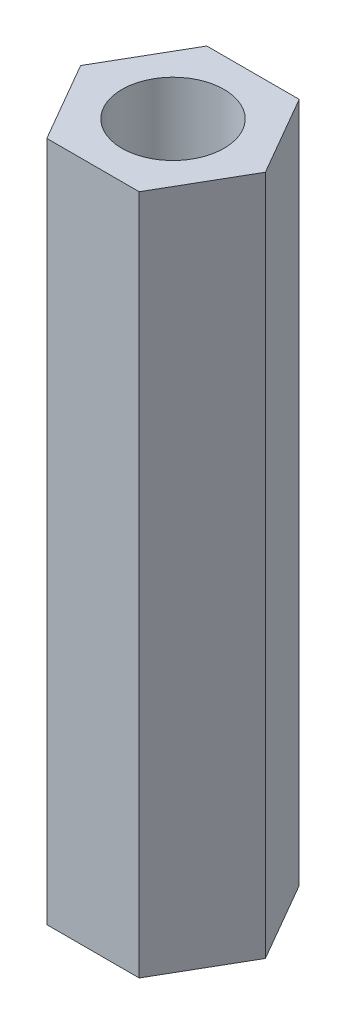
ISO-10303-21;
HEADER;
FILE_DESCRIPTION(('STEP AP214'),'2;1');
FILE_NAME('part.step','',(''),(''),'','','');
FILE_SCHEMA(('AUTOMOTIVE_DESIGN { 1 0 10303 214 1 1 1 1 }'));
ENDSEC;
DATA;
#1=APPLICATION_CONTEXT('core data for automotive mechanical design processes');
#2=APPLICATION_PROTOCOL_DEFINITION('international standard','automotive_design',2000,#1);
#3=PRODUCT_CONTEXT('',#1,'mechanical');
#4=PRODUCT('Part','Part','',(#3));
#5=PRODUCT_RELATED_PRODUCT_CATEGORY('part','',(#4));
#6=PRODUCT_DEFINITION_FORMATION('','',#4);
#7=PRODUCT_DEFINITION_CONTEXT('part definition',#1,'design');
#8=PRODUCT_DEFINITION('design','',#6,#7);
#9=PRODUCT_DEFINITION_SHAPE('','',#8);
#10=(LENGTH_UNIT() NAMED_UNIT(*) SI_UNIT(.MILLI.,.METRE.));
#11=(NAMED_UNIT(*) PLANE_ANGLE_UNIT() SI_UNIT($,.RADIAN.));
#12=(NAMED_UNIT(*) SI_UNIT($,.STERADIAN.) SOLID_ANGLE_UNIT());
#13=UNCERTAINTY_MEASURE_WITH_UNIT(LENGTH_MEASURE(1.E-05),#10,'distance_accuracy_value','');
#14=(GEOMETRIC_REPRESENTATION_CONTEXT(3) GLOBAL_UNCERTAINTY_ASSIGNED_CONTEXT((#13)) GLOBAL_UNIT_ASSIGNED_CONTEXT((#10,
#11,#12)) REPRESENTATION_CONTEXT('',''));
#15=CARTESIAN_POINT('',(0.,0.,0.));
#16=DIRECTION('',(0.,0.,1.));
#17=DIRECTION('',(1.,0.,0.));
#18=AXIS2_PLACEMENT_3D('',#15,#16,#17);
#19=CARTESIAN_POINT('',(0.,20.,0.));
#20=DIRECTION('',(0.,1.,0.));
#21=DIRECTION('',(0.,0.,1.));
#22=AXIS2_PLACEMENT_3D('',#19,#20,#21);
#23=PLANE('',#22);
#24=DIRECTION('',(0.499999999999985,0.,-0.866025403784447));
#25=VECTOR('',#24,1.);
#26=CARTESIAN_POINT('',(1.35677313259566,20.,2.35000000000002));
#27=LINE('',#26,#25);
#28=CARTESIAN_POINT('',(1.35677313259566,20.,2.35000000000002));
#29=VERTEX_POINT('',#28);
#30=CARTESIAN_POINT('',(2.71354626519124,20.,0.));
#31=VERTEX_POINT('',#30);
#32=EDGE_CURVE('E128',#29,#31,#27,.T.);
#33=ORIENTED_EDGE('',*,*,#32,.T.);
#34=DIRECTION('',(-0.500000000000015,0.,-0.86602540378443));
#35=VECTOR('',#34,1.);
#36=CARTESIAN_POINT('',(2.71354626519124,20.,0.));
#37=LINE('',#36,#35);
#38=CARTESIAN_POINT('',(1.35677313259558,20.,-2.34999999999998));
#39=VERTEX_POINT('',#38);
#40=EDGE_CURVE('E86',#31,#39,#37,.T.);
#41=ORIENTED_EDGE('',*,*,#40,.T.);
#42=DIRECTION('',(-1.,0.,0.));
#43=VECTOR('',#42,1.);
#44=CARTESIAN_POINT('',(1.35677313259558,20.,-2.34999999999998));
#45=LINE('',#44,#43);
#46=CARTESIAN_POINT('',(-1.35677313259566,20.,-2.34999999999994));
#47=VERTEX_POINT('',#46);
#48=EDGE_CURVE('E99',#39,#47,#45,.T.);
#49=ORIENTED_EDGE('',*,*,#48,.T.);
#50=DIRECTION('',(-0.499999999999985,0.,0.866025403784447));
#51=VECTOR('',#50,1.);
#52=CARTESIAN_POINT('',(-1.35677313259566,20.,-2.34999999999994));
#53=LINE('',#52,#51);
#54=CARTESIAN_POINT('',(-2.71354626519124,20.,0.));
#55=VERTEX_POINT('',#54);
#56=EDGE_CURVE('E93',#47,#55,#53,.T.);
#57=ORIENTED_EDGE('',*,*,#56,.T.);
#58=DIRECTION('',(0.500000000000015,0.,0.86602540378443));
#59=VECTOR('',#58,1.);
#60=CARTESIAN_POINT('',(-2.71354626519124,20.,0.));
#61=LINE('',#60,#59);
#62=CARTESIAN_POINT('',(-1.35677313259558,20.,2.35000000000006));
#63=VERTEX_POINT('',#62);
#64=EDGE_CURVE('E97',#55,#63,#61,.T.);
#65=ORIENTED_EDGE('',*,*,#64,.T.);
#66=DIRECTION('',(1.,0.,0.));
#67=VECTOR('',#66,1.);
#68=CARTESIAN_POINT('',(-1.35677313259558,20.,2.35000000000006));
#69=LINE('',#68,#67);
#70=EDGE_CURVE('E49',#63,#29,#69,.T.);
#71=ORIENTED_EDGE('',*,*,#70,.T.);
#72=EDGE_LOOP('',(#33,#41,#49,#57,#65,#71));
#73=FACE_BOUND('',#72,.T.);
#74=CARTESIAN_POINT('',(0.,20.,0.));
#75=DIRECTION('',(0.,1.,0.));
#76=DIRECTION('',(0.,0.,1.));
#77=AXIS2_PLACEMENT_3D('',#74,#75,#76);
#78=CIRCLE('',#77,1.5);
#79=CARTESIAN_POINT('',(0.,20.,1.5));
#80=VERTEX_POINT('',#79);
#81=EDGE_CURVE('E121',#80,#80,#78,.T.);
#82=ORIENTED_EDGE('',*,*,#81,.F.);
#83=EDGE_LOOP('',(#82));
#84=FACE_BOUND('',#83,.T.);
#85=ADVANCED_FACE('F32',(#73,#84),#23,.T.);
#86=CARTESIAN_POINT('',(0.,0.,0.));
#87=DIRECTION('',(0.,1.,0.));
#88=DIRECTION('',(0.,0.,1.));
#89=AXIS2_PLACEMENT_3D('',#86,#87,#88);
#90=PLANE('',#89);
#91=DIRECTION('',(0.499999999999985,0.,-0.866025403784447));
#92=VECTOR('',#91,1.);
#93=CARTESIAN_POINT('',(1.35677313259566,0.,2.35000000000002));
#94=LINE('',#93,#92);
#95=CARTESIAN_POINT('',(1.35677313259566,0.,2.35000000000002));
#96=VERTEX_POINT('',#95);
#97=CARTESIAN_POINT('',(2.71354626519124,0.,0.));
#98=VERTEX_POINT('',#97);
#99=EDGE_CURVE('E117',#96,#98,#94,.T.);
#100=ORIENTED_EDGE('',*,*,#99,.F.);
#101=DIRECTION('',(1.,0.,0.));
#102=VECTOR('',#101,1.);
#103=CARTESIAN_POINT('',(-1.35677313259558,0.,2.35000000000006));
#104=LINE('',#103,#102);
#105=CARTESIAN_POINT('',(-1.35677313259558,0.,2.35000000000006));
#106=VERTEX_POINT('',#105);
#107=EDGE_CURVE('E78',#106,#96,#104,.T.);
#108=ORIENTED_EDGE('',*,*,#107,.F.);
#109=DIRECTION('',(0.500000000000015,0.,0.86602540378443));
#110=VECTOR('',#109,1.);
#111=CARTESIAN_POINT('',(-2.71354626519124,0.,0.));
#112=LINE('',#111,#110);
#113=CARTESIAN_POINT('',(-2.71354626519124,0.,0.));
#114=VERTEX_POINT('',#113);
#115=EDGE_CURVE('E72',#114,#106,#112,.T.);
#116=ORIENTED_EDGE('',*,*,#115,.F.);
#117=DIRECTION('',(-0.499999999999985,0.,0.866025403784447));
#118=VECTOR('',#117,1.);
#119=CARTESIAN_POINT('',(-1.35677313259566,0.,-2.34999999999994));
#120=LINE('',#119,#118);
#121=CARTESIAN_POINT('',(-1.35677313259566,0.,-2.34999999999994));
#122=VERTEX_POINT('',#121);
#123=EDGE_CURVE('E107',#122,#114,#120,.T.);
#124=ORIENTED_EDGE('',*,*,#123,.F.);
#125=DIRECTION('',(-1.,0.,0.));
#126=VECTOR('',#125,1.);
#127=CARTESIAN_POINT('',(1.35677313259558,0.,-2.34999999999998));
#128=LINE('',#127,#126);
#129=CARTESIAN_POINT('',(1.35677313259558,0.,-2.34999999999998));
#130=VERTEX_POINT('',#129);
#131=EDGE_CURVE('E123',#130,#122,#128,.T.);
#132=ORIENTED_EDGE('',*,*,#131,.F.);
#133=DIRECTION('',(-0.500000000000015,0.,-0.86602540378443));
#134=VECTOR('',#133,1.);
#135=CARTESIAN_POINT('',(2.71354626519124,0.,0.));
#136=LINE('',#135,#134);
#137=EDGE_CURVE('E120',#98,#130,#136,.T.);
#138=ORIENTED_EDGE('',*,*,#137,.F.);
#139=EDGE_LOOP('',(#100,#108,#116,#124,#132,#138));
#140=FACE_BOUND('',#139,.T.);
#141=CARTESIAN_POINT('',(0.,0.,0.));
#142=DIRECTION('',(0.,1.,0.));
#143=DIRECTION('',(0.,0.,1.));
#144=AXIS2_PLACEMENT_3D('',#141,#142,#143);
#145=CIRCLE('',#144,1.5);
#146=CARTESIAN_POINT('',(0.,0.,1.5));
#147=VERTEX_POINT('',#146);
#148=EDGE_CURVE('E221',#147,#147,#145,.T.);
#149=ORIENTED_EDGE('',*,*,#148,.T.);
#150=EDGE_LOOP('',(#149));
#151=FACE_BOUND('',#150,.T.);
#152=ADVANCED_FACE('F137',(#140,#151),#90,.F.);
#153=CARTESIAN_POINT('',(1.35677313259566,20.,2.35000000000002));
#154=DIRECTION('',(-0.866025403784447,0.,-0.499999999999985));
#155=DIRECTION('',(-0.499999999999985,0.,0.866025403784447));
#156=AXIS2_PLACEMENT_3D('',#153,#154,#155);
#157=PLANE('',#156);
#158=ORIENTED_EDGE('',*,*,#99,.T.);
#159=DIRECTION('',(0.,-1.,0.));
#160=VECTOR('',#159,1.);
#161=CARTESIAN_POINT('',(2.71354626519124,20.,0.));
#162=LINE('',#161,#160);
#163=EDGE_CURVE('E11',#31,#98,#162,.T.);
#164=ORIENTED_EDGE('',*,*,#163,.F.);
#165=ORIENTED_EDGE('',*,*,#32,.F.);
#166=DIRECTION('',(0.,-1.,0.));
#167=VECTOR('',#166,1.);
#168=CARTESIAN_POINT('',(1.35677313259566,20.,2.35000000000002));
#169=LINE('',#168,#167);
#170=EDGE_CURVE('E113',#29,#96,#169,.T.);
#171=ORIENTED_EDGE('',*,*,#170,.T.);
#172=EDGE_LOOP('',(#158,#164,#165,#171));
#173=FACE_BOUND('',#172,.T.);
#174=ADVANCED_FACE('F34',(#173),#157,.F.);
#175=CARTESIAN_POINT('',(2.71354626519124,20.,0.));
#176=DIRECTION('',(-0.86602540378443,0.,0.500000000000015));
#177=DIRECTION('',(0.500000000000015,0.,0.86602540378443));
#178=AXIS2_PLACEMENT_3D('',#175,#176,#177);
#179=PLANE('',#178);
#180=ORIENTED_EDGE('',*,*,#137,.T.);
#181=DIRECTION('',(0.,-1.,0.));
#182=VECTOR('',#181,1.);
#183=CARTESIAN_POINT('',(1.35677313259558,20.,-2.34999999999998));
#184=LINE('',#183,#182);
#185=EDGE_CURVE('E41',#39,#130,#184,.T.);
#186=ORIENTED_EDGE('',*,*,#185,.F.);
#187=ORIENTED_EDGE('',*,*,#40,.F.);
#188=ORIENTED_EDGE('',*,*,#163,.T.);
#189=EDGE_LOOP('',(#180,#186,#187,#188));
#190=FACE_BOUND('',#189,.T.);
#191=ADVANCED_FACE('F162',(#190),#179,.F.);
#192=CARTESIAN_POINT('',(1.35677313259558,20.,-2.34999999999998));
#193=DIRECTION('',(0.,0.,1.));
#194=DIRECTION('',(1.,0.,0.));
#195=AXIS2_PLACEMENT_3D('',#192,#193,#194);
#196=PLANE('',#195);
#197=ORIENTED_EDGE('',*,*,#131,.T.);
#198=DIRECTION('',(0.,-1.,0.));
#199=VECTOR('',#198,1.);
#200=CARTESIAN_POINT('',(-1.35677313259566,20.,-2.34999999999994));
#201=LINE('',#200,#199);
#202=EDGE_CURVE('E108',#47,#122,#201,.T.);
#203=ORIENTED_EDGE('',*,*,#202,.F.);
#204=ORIENTED_EDGE('',*,*,#48,.F.);
#205=ORIENTED_EDGE('',*,*,#185,.T.);
#206=EDGE_LOOP('',(#197,#203,#204,#205));
#207=FACE_BOUND('',#206,.T.);
#208=ADVANCED_FACE('F134',(#207),#196,.F.);
#209=CARTESIAN_POINT('',(-1.35677313259566,20.,-2.34999999999994));
#210=DIRECTION('',(0.866025403784447,0.,0.499999999999985));
#211=DIRECTION('',(0.499999999999985,0.,-0.866025403784447));
#212=AXIS2_PLACEMENT_3D('',#209,#210,#211);
#213=PLANE('',#212);
#214=ORIENTED_EDGE('',*,*,#123,.T.);
#215=DIRECTION('',(0.,-1.,0.));
#216=VECTOR('',#215,1.);
#217=CARTESIAN_POINT('',(-2.71354626519124,20.,0.));
#218=LINE('',#217,#216);
#219=EDGE_CURVE('E104',#55,#114,#218,.T.);
#220=ORIENTED_EDGE('',*,*,#219,.F.);
#221=ORIENTED_EDGE('',*,*,#56,.F.);
#222=ORIENTED_EDGE('',*,*,#202,.T.);
#223=EDGE_LOOP('',(#214,#220,#221,#222));
#224=FACE_BOUND('',#223,.T.);
#225=ADVANCED_FACE('F105',(#224),#213,.F.);
#226=CARTESIAN_POINT('',(-2.71354626519124,20.,0.));
#227=DIRECTION('',(0.86602540378443,0.,-0.500000000000015));
#228=DIRECTION('',(-0.500000000000015,0.,-0.86602540378443));
#229=AXIS2_PLACEMENT_3D('',#226,#227,#228);
#230=PLANE('',#229);
#231=ORIENTED_EDGE('',*,*,#115,.T.);
#232=DIRECTION('',(0.,-1.,0.));
#233=VECTOR('',#232,1.);
#234=CARTESIAN_POINT('',(-1.35677313259558,20.,2.35000000000006));
#235=LINE('',#234,#233);
#236=EDGE_CURVE('E109',#63,#106,#235,.T.);
#237=ORIENTED_EDGE('',*,*,#236,.F.);
#238=ORIENTED_EDGE('',*,*,#64,.F.);
#239=ORIENTED_EDGE('',*,*,#219,.T.);
#240=EDGE_LOOP('',(#231,#237,#238,#239));
#241=FACE_BOUND('',#240,.T.);
#242=ADVANCED_FACE('F111',(#241),#230,.F.);
#243=CARTESIAN_POINT('',(-1.35677313259558,20.,2.35000000000006));
#244=DIRECTION('',(0.,0.,-1.));
#245=DIRECTION('',(-1.,0.,0.));
#246=AXIS2_PLACEMENT_3D('',#243,#244,#245);
#247=PLANE('',#246);
#248=ORIENTED_EDGE('',*,*,#107,.T.);
#249=ORIENTED_EDGE('',*,*,#170,.F.);
#250=ORIENTED_EDGE('',*,*,#70,.F.);
#251=ORIENTED_EDGE('',*,*,#236,.T.);
#252=EDGE_LOOP('',(#248,#249,#250,#251));
#253=FACE_BOUND('',#252,.T.);
#254=ADVANCED_FACE('F142',(#253),#247,.F.);
#255=CARTESIAN_POINT('',(0.,20.,0.));
#256=DIRECTION('',(0.,-1.,0.));
#257=DIRECTION('',(0.,0.,-1.));
#258=AXIS2_PLACEMENT_3D('',#255,#256,#257);
#259=CYLINDRICAL_SURFACE('',#258,1.5);
#260=ORIENTED_EDGE('',*,*,#81,.T.);
#261=EDGE_LOOP('',(#260));
#262=FACE_BOUND('',#261,.T.);
#263=ORIENTED_EDGE('',*,*,#148,.F.);
#264=EDGE_LOOP('',(#263));
#265=FACE_BOUND('',#264,.T.);
#266=ADVANCED_FACE('F144',(#262,#265),#259,.F.);
#267=CLOSED_SHELL('',(#85,#152,#174,#191,#208,#225,#242,#254,#266));
#268=MANIFOLD_SOLID_BREP('B2',#267);
#269=ADVANCED_BREP_SHAPE_REPRESENTATION('',(#18,#268),#14);
#270=SHAPE_DEFINITION_REPRESENTATION(#9,#269);
ENDSEC;
END-ISO-10303-21;
